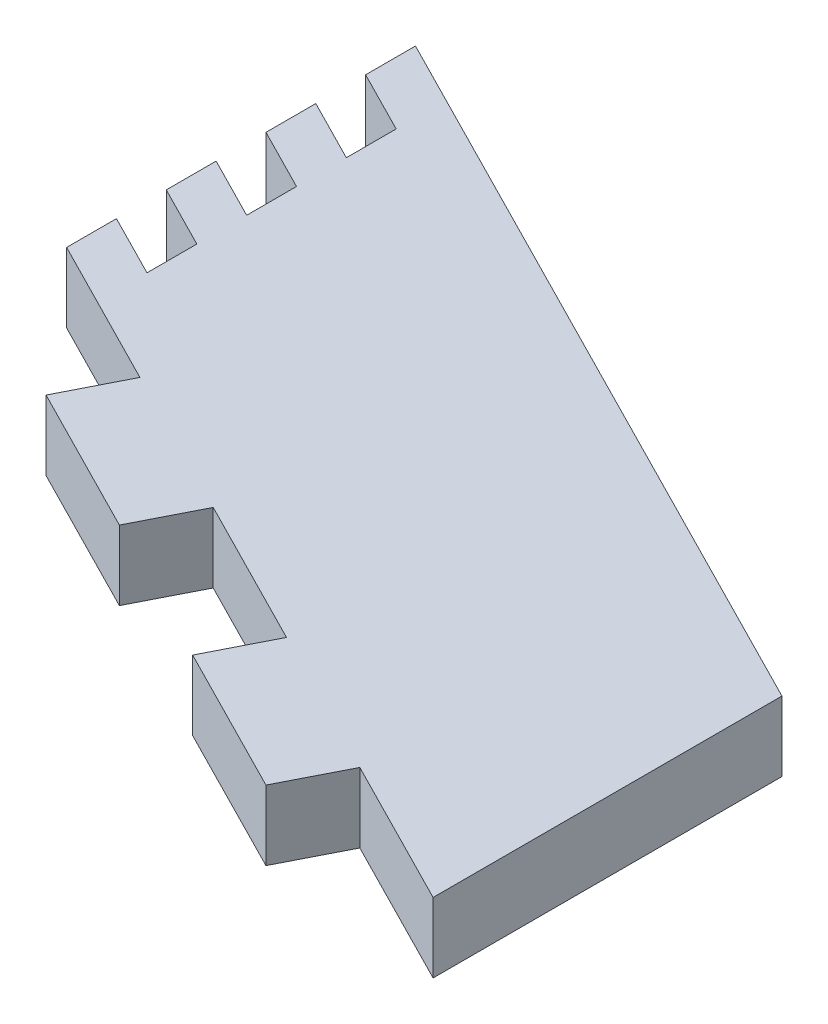
ISO-10303-21;
HEADER;
FILE_DESCRIPTION(('STEP AP214'),'2;1');
FILE_NAME('part.step','',(''),(''),'','','');
FILE_SCHEMA(('AUTOMOTIVE_DESIGN { 1 0 10303 214 1 1 1 1 }'));
ENDSEC;
DATA;
#1=APPLICATION_CONTEXT('core data for automotive mechanical design processes');
#2=APPLICATION_PROTOCOL_DEFINITION('international standard','automotive_design',2000,#1);
#3=PRODUCT_CONTEXT('',#1,'mechanical');
#4=PRODUCT('Part','Part','',(#3));
#5=PRODUCT_RELATED_PRODUCT_CATEGORY('part','',(#4));
#6=PRODUCT_DEFINITION_FORMATION('','',#4);
#7=PRODUCT_DEFINITION_CONTEXT('part definition',#1,'design');
#8=PRODUCT_DEFINITION('design','',#6,#7);
#9=PRODUCT_DEFINITION_SHAPE('','',#8);
#10=(LENGTH_UNIT() NAMED_UNIT(*) SI_UNIT(.MILLI.,.METRE.));
#11=(NAMED_UNIT(*) PLANE_ANGLE_UNIT() SI_UNIT($,.RADIAN.));
#12=(NAMED_UNIT(*) SI_UNIT($,.STERADIAN.) SOLID_ANGLE_UNIT());
#13=UNCERTAINTY_MEASURE_WITH_UNIT(LENGTH_MEASURE(1.E-05),#10,'distance_accuracy_value','');
#14=(GEOMETRIC_REPRESENTATION_CONTEXT(3) GLOBAL_UNCERTAINTY_ASSIGNED_CONTEXT((#13)) GLOBAL_UNIT_ASSIGNED_CONTEXT((#10,
#11,#12)) REPRESENTATION_CONTEXT('',''));
#15=CARTESIAN_POINT('',(0.,0.,0.));
#16=DIRECTION('',(0.,0.,1.));
#17=DIRECTION('',(1.,0.,0.));
#18=AXIS2_PLACEMENT_3D('',#15,#16,#17);
#19=CARTESIAN_POINT('',(0.,3.,0.));
#20=DIRECTION('',(1.,0.,0.));
#21=DIRECTION('',(0.,0.,-1.));
#22=AXIS2_PLACEMENT_3D('',#19,#20,#21);
#23=PLANE('',#22);
#24=DIRECTION('',(0.,0.,1.));
#25=VECTOR('',#24,1.);
#26=CARTESIAN_POINT('',(0.,3.,0.));
#27=LINE('',#26,#25);
#28=CARTESIAN_POINT('',(0.,3.,-2.14285785714291));
#29=VERTEX_POINT('',#28);
#30=CARTESIAN_POINT('',(0.,3.,0.));
#31=VERTEX_POINT('',#30);
#32=EDGE_CURVE('E355',#29,#31,#27,.T.);
#33=ORIENTED_EDGE('',*,*,#32,.F.);
#34=DIRECTION('',(0.,1.,0.));
#35=VECTOR('',#34,1.);
#36=CARTESIAN_POINT('',(0.,0.,-2.14285785714291));
#37=LINE('',#36,#35);
#38=CARTESIAN_POINT('',(0.,0.,-2.14285785714291));
#39=VERTEX_POINT('',#38);
#40=EDGE_CURVE('E236',#39,#29,#37,.T.);
#41=ORIENTED_EDGE('',*,*,#40,.F.);
#42=DIRECTION('',(0.,0.,1.));
#43=VECTOR('',#42,1.);
#44=CARTESIAN_POINT('',(0.,0.,0.));
#45=LINE('',#44,#43);
#46=CARTESIAN_POINT('',(0.,0.,0.));
#47=VERTEX_POINT('',#46);
#48=EDGE_CURVE('E226',#39,#47,#45,.T.);
#49=ORIENTED_EDGE('',*,*,#48,.T.);
#50=DIRECTION('',(0.,-1.,0.));
#51=VECTOR('',#50,1.);
#52=CARTESIAN_POINT('',(0.,3.,0.));
#53=LINE('',#52,#51);
#54=EDGE_CURVE('E359',#31,#47,#53,.T.);
#55=ORIENTED_EDGE('',*,*,#54,.F.);
#56=EDGE_LOOP('',(#33,#41,#49,#55));
#57=FACE_BOUND('',#56,.T.);
#58=ADVANCED_FACE('F44',(#57),#23,.F.);
#59=CARTESIAN_POINT('',(0.,0.,-6.42857185714291));
#60=VERTEX_POINT('',#59);
#61=CARTESIAN_POINT('',(0.,0.,-4.28571485714291));
#62=VERTEX_POINT('',#61);
#63=EDGE_CURVE('E432',#60,#62,#45,.T.);
#64=ORIENTED_EDGE('',*,*,#63,.T.);
#65=DIRECTION('',(0.,1.,0.));
#66=VECTOR('',#65,1.);
#67=CARTESIAN_POINT('',(0.,0.,-4.28571485714291));
#68=LINE('',#67,#66);
#69=CARTESIAN_POINT('',(0.,3.,-4.28571485714291));
#70=VERTEX_POINT('',#69);
#71=EDGE_CURVE('E239',#62,#70,#68,.T.);
#72=ORIENTED_EDGE('',*,*,#71,.T.);
#73=CARTESIAN_POINT('',(0.,3.,-6.42857185714291));
#74=VERTEX_POINT('',#73);
#75=EDGE_CURVE('E431',#74,#70,#27,.T.);
#76=ORIENTED_EDGE('',*,*,#75,.F.);
#77=DIRECTION('',(0.,1.,0.));
#78=VECTOR('',#77,1.);
#79=CARTESIAN_POINT('',(0.,0.,-6.42857185714291));
#80=LINE('',#79,#78);
#81=EDGE_CURVE('E247',#60,#74,#80,.T.);
#82=ORIENTED_EDGE('',*,*,#81,.F.);
#83=EDGE_LOOP('',(#64,#72,#76,#82));
#84=FACE_BOUND('',#83,.T.);
#85=ADVANCED_FACE('F455',(#84),#23,.F.);
#86=CARTESIAN_POINT('',(0.,0.,-10.7142858571429));
#87=VERTEX_POINT('',#86);
#88=CARTESIAN_POINT('',(0.,0.,-8.57142885714291));
#89=VERTEX_POINT('',#88);
#90=EDGE_CURVE('E371',#87,#89,#45,.T.);
#91=ORIENTED_EDGE('',*,*,#90,.T.);
#92=DIRECTION('',(0.,1.,0.));
#93=VECTOR('',#92,1.);
#94=CARTESIAN_POINT('',(0.,0.,-8.57142885714291));
#95=LINE('',#94,#93);
#96=CARTESIAN_POINT('',(0.,3.,-8.57142885714291));
#97=VERTEX_POINT('',#96);
#98=EDGE_CURVE('E67',#89,#97,#95,.T.);
#99=ORIENTED_EDGE('',*,*,#98,.T.);
#100=CARTESIAN_POINT('',(0.,3.,-10.7142858571429));
#101=VERTEX_POINT('',#100);
#102=EDGE_CURVE('E360',#101,#97,#27,.T.);
#103=ORIENTED_EDGE('',*,*,#102,.F.);
#104=DIRECTION('',(0.,1.,0.));
#105=VECTOR('',#104,1.);
#106=CARTESIAN_POINT('',(0.,0.,-10.7142858571429));
#107=LINE('',#106,#105);
#108=EDGE_CURVE('E272',#87,#101,#107,.T.);
#109=ORIENTED_EDGE('',*,*,#108,.F.);
#110=EDGE_LOOP('',(#91,#99,#103,#109));
#111=FACE_BOUND('',#110,.T.);
#112=ADVANCED_FACE('F441',(#111),#23,.F.);
#113=CARTESIAN_POINT('',(32.0847879927621,3.,16.3268606737336));
#114=DIRECTION('',(0.453523907603711,0.,-0.891244110910058));
#115=DIRECTION('',(-0.891244110910059,0.,-0.453523907603711));
#116=AXIS2_PLACEMENT_3D('',#113,#114,#115);
#117=PLANE('',#116);
#118=DIRECTION('',(0.891244110910059,0.,0.453523907603711));
#119=VECTOR('',#118,1.);
#120=CARTESIAN_POINT('',(32.0847879927621,3.,16.3268606737336));
#121=LINE('',#120,#119);
#122=CARTESIAN_POINT('',(12.8339151939046,3.,6.53074426786497));
#123=VERTEX_POINT('',#122);
#124=CARTESIAN_POINT('',(19.2508727924571,3.,9.79611640261169));
#125=VERTEX_POINT('',#124);
#126=EDGE_CURVE('E350',#123,#125,#121,.T.);
#127=ORIENTED_EDGE('',*,*,#126,.F.);
#128=DIRECTION('',(0.,1.,0.));
#129=VECTOR('',#128,1.);
#130=CARTESIAN_POINT('',(12.8339151939046,0.,6.53074426786497));
#131=LINE('',#130,#129);
#132=CARTESIAN_POINT('',(12.8339151939046,0.,6.53074426786497));
#133=VERTEX_POINT('',#132);
#134=EDGE_CURVE('E238',#133,#123,#131,.T.);
#135=ORIENTED_EDGE('',*,*,#134,.F.);
#136=DIRECTION('',(0.891244110910059,0.,0.453523907603711));
#137=VECTOR('',#136,1.);
#138=CARTESIAN_POINT('',(32.0847879927621,0.,16.3268606737336));
#139=LINE('',#138,#137);
#140=CARTESIAN_POINT('',(19.2508727924571,0.,9.79611640261169));
#141=VERTEX_POINT('',#140);
#142=EDGE_CURVE('E364',#133,#141,#139,.T.);
#143=ORIENTED_EDGE('',*,*,#142,.T.);
#144=DIRECTION('',(0.,1.,0.));
#145=VECTOR('',#144,1.);
#146=CARTESIAN_POINT('',(19.2508727924571,0.,9.79611640261169));
#147=LINE('',#146,#145);
#148=EDGE_CURVE('E328',#141,#125,#147,.T.);
#149=ORIENTED_EDGE('',*,*,#148,.T.);
#150=EDGE_LOOP('',(#127,#135,#143,#149));
#151=FACE_BOUND('',#150,.T.);
#152=ADVANCED_FACE('F404',(#151),#117,.F.);
#153=CARTESIAN_POINT('',(25.6678303910095,3.,13.0614885373584));
#154=VERTEX_POINT('',#153);
#155=CARTESIAN_POINT('',(32.0847879927621,3.,16.3268606737336));
#156=VERTEX_POINT('',#155);
#157=EDGE_CURVE('E351',#154,#156,#121,.T.);
#158=ORIENTED_EDGE('',*,*,#157,.F.);
#159=DIRECTION('',(0.,1.,0.));
#160=VECTOR('',#159,1.);
#161=CARTESIAN_POINT('',(25.6678303910095,0.,13.0614885373584));
#162=LINE('',#161,#160);
#163=CARTESIAN_POINT('',(25.6678303910095,0.,13.0614885373584));
#164=VERTEX_POINT('',#163);
#165=EDGE_CURVE('E336',#164,#154,#162,.T.);
#166=ORIENTED_EDGE('',*,*,#165,.F.);
#167=CARTESIAN_POINT('',(32.0847879927621,0.,16.3268606737336));
#168=VERTEX_POINT('',#167);
#169=EDGE_CURVE('E339',#164,#168,#139,.T.);
#170=ORIENTED_EDGE('',*,*,#169,.T.);
#171=DIRECTION('',(0.,-1.,0.));
#172=VECTOR('',#171,1.);
#173=CARTESIAN_POINT('',(32.0847879927621,3.,16.3268606737336));
#174=LINE('',#173,#172);
#175=EDGE_CURVE('E11',#156,#168,#174,.T.);
#176=ORIENTED_EDGE('',*,*,#175,.F.);
#177=EDGE_LOOP('',(#158,#166,#170,#176));
#178=FACE_BOUND('',#177,.T.);
#179=ADVANCED_FACE('F398',(#178),#117,.F.);
#180=CARTESIAN_POINT('',(6.41695759535222,0.,3.26537213311825));
#181=VERTEX_POINT('',#180);
#182=EDGE_CURVE('E361',#47,#181,#139,.T.);
#183=ORIENTED_EDGE('',*,*,#182,.T.);
#184=DIRECTION('',(0.,1.,0.));
#185=VECTOR('',#184,1.);
#186=CARTESIAN_POINT('',(6.41695759535222,0.,3.26537213311825));
#187=LINE('',#186,#185);
#188=CARTESIAN_POINT('',(6.41695759535222,3.,3.26537213311825));
#189=VERTEX_POINT('',#188);
#190=EDGE_CURVE('E291',#181,#189,#187,.T.);
#191=ORIENTED_EDGE('',*,*,#190,.T.);
#192=EDGE_CURVE('E346',#31,#189,#121,.T.);
#193=ORIENTED_EDGE('',*,*,#192,.F.);
#194=ORIENTED_EDGE('',*,*,#54,.T.);
#195=EDGE_LOOP('',(#183,#191,#193,#194));
#196=FACE_BOUND('',#195,.T.);
#197=ADVANCED_FACE('F46',(#196),#117,.F.);
#198=CARTESIAN_POINT('',(32.0847879927621,3.,1.32686067373359));
#199=DIRECTION('',(-1.,0.,0.));
#200=DIRECTION('',(0.,0.,1.));
#201=AXIS2_PLACEMENT_3D('',#198,#199,#200);
#202=PLANE('',#201);
#203=DIRECTION('',(0.,0.,-1.));
#204=VECTOR('',#203,1.);
#205=CARTESIAN_POINT('',(32.0847879927621,0.,1.32686067373359));
#206=LINE('',#205,#204);
#207=CARTESIAN_POINT('',(32.0847879927621,0.,1.32686067373359));
#208=VERTEX_POINT('',#207);
#209=EDGE_CURVE('E363',#168,#208,#206,.T.);
#210=ORIENTED_EDGE('',*,*,#209,.T.);
#211=DIRECTION('',(0.,-1.,0.));
#212=VECTOR('',#211,1.);
#213=CARTESIAN_POINT('',(32.0847879927621,3.,1.32686067373359));
#214=LINE('',#213,#212);
#215=CARTESIAN_POINT('',(32.0847879927621,3.,1.32686067373359));
#216=VERTEX_POINT('',#215);
#217=EDGE_CURVE('E52',#216,#208,#214,.T.);
#218=ORIENTED_EDGE('',*,*,#217,.F.);
#219=DIRECTION('',(0.,0.,-1.));
#220=VECTOR('',#219,1.);
#221=CARTESIAN_POINT('',(32.0847879927621,3.,1.32686067373359));
#222=LINE('',#221,#220);
#223=EDGE_CURVE('E349',#156,#216,#222,.T.);
#224=ORIENTED_EDGE('',*,*,#223,.F.);
#225=ORIENTED_EDGE('',*,*,#175,.T.);
#226=EDGE_LOOP('',(#210,#218,#224,#225));
#227=FACE_BOUND('',#226,.T.);
#228=ADVANCED_FACE('F396',(#227),#202,.F.);
#229=CARTESIAN_POINT('',(0.,3.,-15.));
#230=DIRECTION('',(-0.453523907603711,0.,0.891244110910058));
#231=DIRECTION('',(0.891244110910059,0.,0.453523907603711));
#232=AXIS2_PLACEMENT_3D('',#229,#230,#231);
#233=PLANE('',#232);
#234=DIRECTION('',(-0.891244110910059,0.,-0.453523907603711));
#235=VECTOR('',#234,1.);
#236=CARTESIAN_POINT('',(0.,0.,-15.));
#237=LINE('',#236,#235);
#238=CARTESIAN_POINT('',(0.,0.,-15.));
#239=VERTEX_POINT('',#238);
#240=EDGE_CURVE('E366',#208,#239,#237,.T.);
#241=ORIENTED_EDGE('',*,*,#240,.T.);
#242=DIRECTION('',(0.,-1.,0.));
#243=VECTOR('',#242,1.);
#244=CARTESIAN_POINT('',(0.,3.,-15.));
#245=LINE('',#244,#243);
#246=CARTESIAN_POINT('',(0.,3.,-15.));
#247=VERTEX_POINT('',#246);
#248=EDGE_CURVE('E374',#247,#239,#245,.T.);
#249=ORIENTED_EDGE('',*,*,#248,.F.);
#250=DIRECTION('',(-0.891244110910059,0.,-0.453523907603711));
#251=VECTOR('',#250,1.);
#252=CARTESIAN_POINT('',(0.,3.,-15.));
#253=LINE('',#252,#251);
#254=EDGE_CURVE('E353',#216,#247,#253,.T.);
#255=ORIENTED_EDGE('',*,*,#254,.F.);
#256=ORIENTED_EDGE('',*,*,#217,.T.);
#257=EDGE_LOOP('',(#241,#249,#255,#256));
#258=FACE_BOUND('',#257,.T.);
#259=ADVANCED_FACE('F381',(#258),#233,.F.);
#260=CARTESIAN_POINT('',(0.,0.,-12.8571428571429));
#261=VERTEX_POINT('',#260);
#262=EDGE_CURVE('E368',#239,#261,#45,.T.);
#263=ORIENTED_EDGE('',*,*,#262,.T.);
#264=DIRECTION('',(0.,1.,0.));
#265=VECTOR('',#264,1.);
#266=CARTESIAN_POINT('',(0.,0.,-12.8571428571429));
#267=LINE('',#266,#265);
#268=CARTESIAN_POINT('',(0.,3.,-12.8571428571429));
#269=VERTEX_POINT('',#268);
#270=EDGE_CURVE('E269',#261,#269,#267,.T.);
#271=ORIENTED_EDGE('',*,*,#270,.T.);
#272=EDGE_CURVE('E356',#247,#269,#27,.T.);
#273=ORIENTED_EDGE('',*,*,#272,.F.);
#274=ORIENTED_EDGE('',*,*,#248,.T.);
#275=EDGE_LOOP('',(#263,#271,#273,#274));
#276=FACE_BOUND('',#275,.T.);
#277=ADVANCED_FACE('F389',(#276),#23,.F.);
#278=CARTESIAN_POINT('',(0.,3.,0.));
#279=DIRECTION('',(0.,-1.,0.));
#280=DIRECTION('',(0.,0.,-1.));
#281=AXIS2_PLACEMENT_3D('',#278,#279,#280);
#282=PLANE('',#281);
#283=DIRECTION('',(0.,0.,-1.));
#284=VECTOR('',#283,1.);
#285=CARTESIAN_POINT('',(2.67373233273017,3.,-0.782286134331796));
#286=LINE('',#285,#284);
#287=CARTESIAN_POINT('',(2.67373233273017,3.,-0.782286134331796));
#288=VERTEX_POINT('',#287);
#289=CARTESIAN_POINT('',(2.67373233273017,3.,-2.92514313433179));
#290=VERTEX_POINT('',#289);
#291=EDGE_CURVE('E229',#288,#290,#286,.T.);
#292=ORIENTED_EDGE('',*,*,#291,.F.);
#293=DIRECTION('',(0.89124411091006,0.,0.453523907603708));
#294=VECTOR('',#293,1.);
#295=CARTESIAN_POINT('',(0.,3.,-2.14285785714291));
#296=LINE('',#295,#294);
#297=EDGE_CURVE('E212',#29,#288,#296,.T.);
#298=ORIENTED_EDGE('',*,*,#297,.F.);
#299=ORIENTED_EDGE('',*,*,#32,.T.);
#300=ORIENTED_EDGE('',*,*,#192,.T.);
#301=DIRECTION('',(-0.453552054669089,0.,0.891229787263334));
#302=VECTOR('',#301,1.);
#303=CARTESIAN_POINT('',(6.41695759535222,3.,3.26537213311825));
#304=LINE('',#303,#302);
#305=CARTESIAN_POINT('',(5.05588889847505,3.,5.93987212199747));
#306=VERTEX_POINT('',#305);
#307=EDGE_CURVE('E307',#189,#306,#304,.T.);
#308=ORIENTED_EDGE('',*,*,#307,.T.);
#309=DIRECTION('',(0.891244110910059,0.,0.453523907603711));
#310=VECTOR('',#309,1.);
#311=CARTESIAN_POINT('',(11.4728464970275,3.,9.20524425674419));
#312=LINE('',#311,#310);
#313=CARTESIAN_POINT('',(11.4728464970275,3.,9.20524425674419));
#314=VERTEX_POINT('',#313);
#315=EDGE_CURVE('E303',#306,#314,#312,.T.);
#316=ORIENTED_EDGE('',*,*,#315,.T.);
#317=DIRECTION('',(0.453552054669089,0.,-0.891229787263334));
#318=VECTOR('',#317,1.);
#319=CARTESIAN_POINT('',(12.8339151939046,3.,6.53074426786497));
#320=LINE('',#319,#318);
#321=EDGE_CURVE('E300',#314,#123,#320,.T.);
#322=ORIENTED_EDGE('',*,*,#321,.T.);
#323=ORIENTED_EDGE('',*,*,#126,.T.);
#324=DIRECTION('',(-0.45355205466909,0.,0.891229787263334));
#325=VECTOR('',#324,1.);
#326=CARTESIAN_POINT('',(19.2508727924571,3.,9.79611640261169));
#327=LINE('',#326,#325);
#328=CARTESIAN_POINT('',(17.8898040955799,3.,12.4706163914909));
#329=VERTEX_POINT('',#328);
#330=EDGE_CURVE('E310',#125,#329,#327,.T.);
#331=ORIENTED_EDGE('',*,*,#330,.T.);
#332=DIRECTION('',(0.891244110910059,0.,0.45352390760371));
#333=VECTOR('',#332,1.);
#334=CARTESIAN_POINT('',(24.3067616941323,3.,15.7359885262376));
#335=LINE('',#334,#333);
#336=CARTESIAN_POINT('',(24.3067616941323,3.,15.7359885262376));
#337=VERTEX_POINT('',#336);
#338=EDGE_CURVE('E331',#329,#337,#335,.T.);
#339=ORIENTED_EDGE('',*,*,#338,.T.);
#340=DIRECTION('',(0.453552054669084,0.,-0.891229787263337));
#341=VECTOR('',#340,1.);
#342=CARTESIAN_POINT('',(25.6678303910095,3.,13.0614885373584));
#343=LINE('',#342,#341);
#344=EDGE_CURVE('E322',#337,#154,#343,.T.);
#345=ORIENTED_EDGE('',*,*,#344,.T.);
#346=ORIENTED_EDGE('',*,*,#157,.T.);
#347=ORIENTED_EDGE('',*,*,#223,.T.);
#348=ORIENTED_EDGE('',*,*,#254,.T.);
#349=ORIENTED_EDGE('',*,*,#272,.T.);
#350=DIRECTION('',(-0.89124411091006,0.,-0.453523907603709));
#351=VECTOR('',#350,1.);
#352=CARTESIAN_POINT('',(0.,3.,-12.8571428571429));
#353=LINE('',#352,#351);
#354=CARTESIAN_POINT('',(2.67373233273017,3.,-11.4965711343318));
#355=VERTEX_POINT('',#354);
#356=EDGE_CURVE('E279',#355,#269,#353,.T.);
#357=ORIENTED_EDGE('',*,*,#356,.F.);
#358=DIRECTION('',(0.,0.,-1.));
#359=VECTOR('',#358,1.);
#360=CARTESIAN_POINT('',(2.67373233273017,3.,-11.4965711343318));
#361=LINE('',#360,#359);
#362=CARTESIAN_POINT('',(2.67373233273017,3.,-9.35371413433179));
#363=VERTEX_POINT('',#362);
#364=EDGE_CURVE('E251',#363,#355,#361,.T.);
#365=ORIENTED_EDGE('',*,*,#364,.F.);
#366=DIRECTION('',(0.891244110910059,0.,0.453523907603709));
#367=VECTOR('',#366,1.);
#368=CARTESIAN_POINT('',(2.67373233273017,3.,-9.35371413433179));
#369=LINE('',#368,#367);
#370=EDGE_CURVE('E276',#101,#363,#369,.T.);
#371=ORIENTED_EDGE('',*,*,#370,.F.);
#372=ORIENTED_EDGE('',*,*,#102,.T.);
#373=DIRECTION('',(-0.89124411091006,0.,-0.453523907603708));
#374=VECTOR('',#373,1.);
#375=CARTESIAN_POINT('',(0.,3.,-8.57142885714291));
#376=LINE('',#375,#374);
#377=CARTESIAN_POINT('',(2.67373233273017,3.,-7.21085713433179));
#378=VERTEX_POINT('',#377);
#379=EDGE_CURVE('E255',#378,#97,#376,.T.);
#380=ORIENTED_EDGE('',*,*,#379,.F.);
#381=DIRECTION('',(0.,0.,-1.));
#382=VECTOR('',#381,1.);
#383=CARTESIAN_POINT('',(2.67373233273017,3.,-7.21085713433179));
#384=LINE('',#383,#382);
#385=CARTESIAN_POINT('',(2.67373233273017,3.,-5.06800013433179));
#386=VERTEX_POINT('',#385);
#387=EDGE_CURVE('E234',#386,#378,#384,.T.);
#388=ORIENTED_EDGE('',*,*,#387,.F.);
#389=DIRECTION('',(0.89124411091006,0.,0.453523907603708));
#390=VECTOR('',#389,1.);
#391=CARTESIAN_POINT('',(2.67373233273017,3.,-5.06800013433179));
#392=LINE('',#391,#390);
#393=EDGE_CURVE('E252',#74,#386,#392,.T.);
#394=ORIENTED_EDGE('',*,*,#393,.F.);
#395=ORIENTED_EDGE('',*,*,#75,.T.);
#396=DIRECTION('',(-0.89124411091006,0.,-0.453523907603709));
#397=VECTOR('',#396,1.);
#398=CARTESIAN_POINT('',(2.67373233273017,3.,-2.92514313433179));
#399=LINE('',#398,#397);
#400=EDGE_CURVE('E227',#290,#70,#399,.T.);
#401=ORIENTED_EDGE('',*,*,#400,.F.);
#402=EDGE_LOOP('',(#292,#298,#299,#300,#308,#316,#322,#323,#331,#339,#345,#346,#347,#348,#349,
#357,#365,#371,#372,#380,#388,#394,#395,#401));
#403=FACE_BOUND('',#402,.T.);
#404=ADVANCED_FACE('F393',(#403),#282,.F.);
#405=CARTESIAN_POINT('',(0.,0.,0.));
#406=DIRECTION('',(0.,-1.,0.));
#407=DIRECTION('',(0.,0.,-1.));
#408=AXIS2_PLACEMENT_3D('',#405,#406,#407);
#409=PLANE('',#408);
#410=DIRECTION('',(0.89124411091006,0.,0.453523907603708));
#411=VECTOR('',#410,1.);
#412=CARTESIAN_POINT('',(0.,0.,-2.14285785714291));
#413=LINE('',#412,#411);
#414=CARTESIAN_POINT('',(2.67373233273017,0.,-0.782286134331796));
#415=VERTEX_POINT('',#414);
#416=EDGE_CURVE('E209',#39,#415,#413,.T.);
#417=ORIENTED_EDGE('',*,*,#416,.T.);
#418=DIRECTION('',(0.,0.,-1.));
#419=VECTOR('',#418,1.);
#420=CARTESIAN_POINT('',(2.67373233273017,0.,-0.782286134331796));
#421=LINE('',#420,#419);
#422=CARTESIAN_POINT('',(2.67373233273017,0.,-2.92514313433179));
#423=VERTEX_POINT('',#422);
#424=EDGE_CURVE('E219',#415,#423,#421,.T.);
#425=ORIENTED_EDGE('',*,*,#424,.T.);
#426=DIRECTION('',(-0.89124411091006,0.,-0.453523907603709));
#427=VECTOR('',#426,1.);
#428=CARTESIAN_POINT('',(2.67373233273017,0.,-2.92514313433179));
#429=LINE('',#428,#427);
#430=EDGE_CURVE('E59',#423,#62,#429,.T.);
#431=ORIENTED_EDGE('',*,*,#430,.T.);
#432=ORIENTED_EDGE('',*,*,#63,.F.);
#433=DIRECTION('',(0.89124411091006,0.,0.453523907603708));
#434=VECTOR('',#433,1.);
#435=CARTESIAN_POINT('',(2.67373233273017,0.,-5.06800013433179));
#436=LINE('',#435,#434);
#437=CARTESIAN_POINT('',(2.67373233273017,0.,-5.06800013433179));
#438=VERTEX_POINT('',#437);
#439=EDGE_CURVE('E245',#60,#438,#436,.T.);
#440=ORIENTED_EDGE('',*,*,#439,.T.);
#441=DIRECTION('',(0.,0.,-1.));
#442=VECTOR('',#441,1.);
#443=CARTESIAN_POINT('',(2.67373233273017,0.,-7.21085713433179));
#444=LINE('',#443,#442);
#445=CARTESIAN_POINT('',(2.67373233273017,0.,-7.21085713433179));
#446=VERTEX_POINT('',#445);
#447=EDGE_CURVE('E256',#438,#446,#444,.T.);
#448=ORIENTED_EDGE('',*,*,#447,.T.);
#449=DIRECTION('',(-0.89124411091006,0.,-0.453523907603708));
#450=VECTOR('',#449,1.);
#451=CARTESIAN_POINT('',(0.,0.,-8.57142885714291));
#452=LINE('',#451,#450);
#453=EDGE_CURVE('E262',#446,#89,#452,.T.);
#454=ORIENTED_EDGE('',*,*,#453,.T.);
#455=ORIENTED_EDGE('',*,*,#90,.F.);
#456=DIRECTION('',(0.891244110910059,0.,0.453523907603709));
#457=VECTOR('',#456,1.);
#458=CARTESIAN_POINT('',(2.67373233273017,0.,-9.35371413433179));
#459=LINE('',#458,#457);
#460=CARTESIAN_POINT('',(2.67373233273017,0.,-9.35371413433179));
#461=VERTEX_POINT('',#460);
#462=EDGE_CURVE('E268',#87,#461,#459,.T.);
#463=ORIENTED_EDGE('',*,*,#462,.T.);
#464=DIRECTION('',(0.,0.,-1.));
#465=VECTOR('',#464,1.);
#466=CARTESIAN_POINT('',(2.67373233273017,0.,-11.4965711343318));
#467=LINE('',#466,#465);
#468=CARTESIAN_POINT('',(2.67373233273017,0.,-11.4965711343318));
#469=VERTEX_POINT('',#468);
#470=EDGE_CURVE('E280',#461,#469,#467,.T.);
#471=ORIENTED_EDGE('',*,*,#470,.T.);
#472=DIRECTION('',(-0.89124411091006,0.,-0.453523907603709));
#473=VECTOR('',#472,1.);
#474=CARTESIAN_POINT('',(0.,0.,-12.8571428571429));
#475=LINE('',#474,#473);
#476=EDGE_CURVE('E286',#469,#261,#475,.T.);
#477=ORIENTED_EDGE('',*,*,#476,.T.);
#478=ORIENTED_EDGE('',*,*,#262,.F.);
#479=ORIENTED_EDGE('',*,*,#240,.F.);
#480=ORIENTED_EDGE('',*,*,#209,.F.);
#481=ORIENTED_EDGE('',*,*,#169,.F.);
#482=DIRECTION('',(0.453552054669084,0.,-0.891229787263337));
#483=VECTOR('',#482,1.);
#484=CARTESIAN_POINT('',(25.6678303910095,0.,13.0614885373584));
#485=LINE('',#484,#483);
#486=CARTESIAN_POINT('',(24.3067616941323,0.,15.7359885262376));
#487=VERTEX_POINT('',#486);
#488=EDGE_CURVE('E325',#487,#164,#485,.T.);
#489=ORIENTED_EDGE('',*,*,#488,.F.);
#490=DIRECTION('',(0.891244110910059,0.,0.45352390760371));
#491=VECTOR('',#490,1.);
#492=CARTESIAN_POINT('',(24.3067616941323,0.,15.7359885262376));
#493=LINE('',#492,#491);
#494=CARTESIAN_POINT('',(17.8898040955799,0.,12.4706163914909));
#495=VERTEX_POINT('',#494);
#496=EDGE_CURVE('E321',#495,#487,#493,.T.);
#497=ORIENTED_EDGE('',*,*,#496,.F.);
#498=DIRECTION('',(-0.45355205466909,0.,0.891229787263334));
#499=VECTOR('',#498,1.);
#500=CARTESIAN_POINT('',(19.2508727924571,0.,9.79611640261169));
#501=LINE('',#500,#499);
#502=EDGE_CURVE('E318',#141,#495,#501,.T.);
#503=ORIENTED_EDGE('',*,*,#502,.F.);
#504=ORIENTED_EDGE('',*,*,#142,.F.);
#505=DIRECTION('',(0.453552054669089,0.,-0.891229787263334));
#506=VECTOR('',#505,1.);
#507=CARTESIAN_POINT('',(12.8339151939046,0.,6.53074426786497));
#508=LINE('',#507,#506);
#509=CARTESIAN_POINT('',(11.4728464970275,0.,9.20524425674419));
#510=VERTEX_POINT('',#509);
#511=EDGE_CURVE('E293',#510,#133,#508,.T.);
#512=ORIENTED_EDGE('',*,*,#511,.F.);
#513=DIRECTION('',(0.891244110910059,0.,0.453523907603711));
#514=VECTOR('',#513,1.);
#515=CARTESIAN_POINT('',(11.4728464970275,0.,9.20524425674419));
#516=LINE('',#515,#514);
#517=CARTESIAN_POINT('',(5.05588889847505,0.,5.93987212199747));
#518=VERTEX_POINT('',#517);
#519=EDGE_CURVE('E313',#518,#510,#516,.T.);
#520=ORIENTED_EDGE('',*,*,#519,.F.);
#521=DIRECTION('',(-0.453552054669089,0.,0.891229787263334));
#522=VECTOR('',#521,1.);
#523=CARTESIAN_POINT('',(6.41695759535222,0.,3.26537213311825));
#524=LINE('',#523,#522);
#525=EDGE_CURVE('E304',#181,#518,#524,.T.);
#526=ORIENTED_EDGE('',*,*,#525,.F.);
#527=ORIENTED_EDGE('',*,*,#182,.F.);
#528=ORIENTED_EDGE('',*,*,#48,.F.);
#529=EDGE_LOOP('',(#417,#425,#431,#432,#440,#448,#454,#455,#463,#471,#477,#478,#479,#480,#481,
#489,#497,#503,#504,#512,#520,#526,#527,#528));
#530=FACE_BOUND('',#529,.T.);
#531=ADVANCED_FACE('F224',(#530),#409,.T.);
#532=CARTESIAN_POINT('',(25.6678303910095,0.,13.0614885373584));
#533=DIRECTION('',(0.891229787263337,0.,0.453552054669084));
#534=DIRECTION('',(0.453552054669084,0.,-0.891229787263337));
#535=AXIS2_PLACEMENT_3D('',#532,#533,#534);
#536=PLANE('',#535);
#537=ORIENTED_EDGE('',*,*,#344,.F.);
#538=DIRECTION('',(0.,1.,0.));
#539=VECTOR('',#538,1.);
#540=CARTESIAN_POINT('',(24.3067616941323,0.,15.7359885262376));
#541=LINE('',#540,#539);
#542=EDGE_CURVE('E340',#487,#337,#541,.T.);
#543=ORIENTED_EDGE('',*,*,#542,.F.);
#544=ORIENTED_EDGE('',*,*,#488,.T.);
#545=ORIENTED_EDGE('',*,*,#165,.T.);
#546=EDGE_LOOP('',(#537,#543,#544,#545));
#547=FACE_BOUND('',#546,.T.);
#548=ADVANCED_FACE('F523',(#547),#536,.T.);
#549=CARTESIAN_POINT('',(24.3067616941323,0.,15.7359885262376));
#550=DIRECTION('',(-0.45352390760371,0.,0.891244110910059));
#551=DIRECTION('',(0.891244110910059,0.,0.45352390760371));
#552=AXIS2_PLACEMENT_3D('',#549,#550,#551);
#553=PLANE('',#552);
#554=ORIENTED_EDGE('',*,*,#338,.F.);
#555=DIRECTION('',(0.,1.,0.));
#556=VECTOR('',#555,1.);
#557=CARTESIAN_POINT('',(17.8898040955799,0.,12.4706163914909));
#558=LINE('',#557,#556);
#559=EDGE_CURVE('E342',#495,#329,#558,.T.);
#560=ORIENTED_EDGE('',*,*,#559,.F.);
#561=ORIENTED_EDGE('',*,*,#496,.T.);
#562=ORIENTED_EDGE('',*,*,#542,.T.);
#563=EDGE_LOOP('',(#554,#560,#561,#562));
#564=FACE_BOUND('',#563,.T.);
#565=ADVANCED_FACE('F413',(#564),#553,.T.);
#566=CARTESIAN_POINT('',(19.2508727924571,0.,9.79611640261169));
#567=DIRECTION('',(-0.891229787263334,0.,-0.453552054669089));
#568=DIRECTION('',(-0.45355205466909,0.,0.891229787263334));
#569=AXIS2_PLACEMENT_3D('',#566,#567,#568);
#570=PLANE('',#569);
#571=ORIENTED_EDGE('',*,*,#330,.F.);
#572=ORIENTED_EDGE('',*,*,#148,.F.);
#573=ORIENTED_EDGE('',*,*,#502,.T.);
#574=ORIENTED_EDGE('',*,*,#559,.T.);
#575=EDGE_LOOP('',(#571,#572,#573,#574));
#576=FACE_BOUND('',#575,.T.);
#577=ADVANCED_FACE('F409',(#576),#570,.T.);
#578=CARTESIAN_POINT('',(12.8339151939046,0.,6.53074426786497));
#579=DIRECTION('',(0.891229787263334,0.,0.453552054669089));
#580=DIRECTION('',(0.453552054669089,0.,-0.891229787263334));
#581=AXIS2_PLACEMENT_3D('',#578,#579,#580);
#582=PLANE('',#581);
#583=ORIENTED_EDGE('',*,*,#321,.F.);
#584=DIRECTION('',(0.,1.,0.));
#585=VECTOR('',#584,1.);
#586=CARTESIAN_POINT('',(11.4728464970275,0.,9.20524425674419));
#587=LINE('',#586,#585);
#588=EDGE_CURVE('E296',#510,#314,#587,.T.);
#589=ORIENTED_EDGE('',*,*,#588,.F.);
#590=ORIENTED_EDGE('',*,*,#511,.T.);
#591=ORIENTED_EDGE('',*,*,#134,.T.);
#592=EDGE_LOOP('',(#583,#589,#590,#591));
#593=FACE_BOUND('',#592,.T.);
#594=ADVANCED_FACE('F417',(#593),#582,.T.);
#595=CARTESIAN_POINT('',(11.4728464970275,0.,9.20524425674419));
#596=DIRECTION('',(-0.453523907603711,0.,0.891244110910059));
#597=DIRECTION('',(0.891244110910059,0.,0.453523907603711));
#598=AXIS2_PLACEMENT_3D('',#595,#596,#597);
#599=PLANE('',#598);
#600=ORIENTED_EDGE('',*,*,#315,.F.);
#601=DIRECTION('',(0.,1.,0.));
#602=VECTOR('',#601,1.);
#603=CARTESIAN_POINT('',(5.05588889847505,0.,5.93987212199747));
#604=LINE('',#603,#602);
#605=EDGE_CURVE('E294',#518,#306,#604,.T.);
#606=ORIENTED_EDGE('',*,*,#605,.F.);
#607=ORIENTED_EDGE('',*,*,#519,.T.);
#608=ORIENTED_EDGE('',*,*,#588,.T.);
#609=EDGE_LOOP('',(#600,#606,#607,#608));
#610=FACE_BOUND('',#609,.T.);
#611=ADVANCED_FACE('F557',(#610),#599,.T.);
#612=CARTESIAN_POINT('',(6.41695759535222,0.,3.26537213311825));
#613=DIRECTION('',(-0.891229787263334,0.,-0.453552054669089));
#614=DIRECTION('',(-0.453552054669089,0.,0.891229787263334));
#615=AXIS2_PLACEMENT_3D('',#612,#613,#614);
#616=PLANE('',#615);
#617=ORIENTED_EDGE('',*,*,#307,.F.);
#618=ORIENTED_EDGE('',*,*,#190,.F.);
#619=ORIENTED_EDGE('',*,*,#525,.T.);
#620=ORIENTED_EDGE('',*,*,#605,.T.);
#621=EDGE_LOOP('',(#617,#618,#619,#620));
#622=FACE_BOUND('',#621,.T.);
#623=ADVANCED_FACE('F424',(#622),#616,.T.);
#624=CARTESIAN_POINT('',(2.67373233273017,0.,-11.4965711343318));
#625=DIRECTION('',(1.,0.,0.));
#626=DIRECTION('',(0.,0.,-1.));
#627=AXIS2_PLACEMENT_3D('',#624,#625,#626);
#628=PLANE('',#627);
#629=ORIENTED_EDGE('',*,*,#364,.T.);
#630=DIRECTION('',(0.,1.,0.));
#631=VECTOR('',#630,1.);
#632=CARTESIAN_POINT('',(2.67373233273017,0.,-11.4965711343318));
#633=LINE('',#632,#631);
#634=EDGE_CURVE('E266',#469,#355,#633,.T.);
#635=ORIENTED_EDGE('',*,*,#634,.F.);
#636=ORIENTED_EDGE('',*,*,#470,.F.);
#637=DIRECTION('',(0.,1.,0.));
#638=VECTOR('',#637,1.);
#639=CARTESIAN_POINT('',(2.67373233273017,0.,-9.35371413433179));
#640=LINE('',#639,#638);
#641=EDGE_CURVE('E274',#461,#363,#640,.T.);
#642=ORIENTED_EDGE('',*,*,#641,.T.);
#643=EDGE_LOOP('',(#629,#635,#636,#642));
#644=FACE_BOUND('',#643,.T.);
#645=ADVANCED_FACE('F576',(#644),#628,.F.);
#646=CARTESIAN_POINT('',(2.67373233273017,0.,-9.35371413433179));
#647=DIRECTION('',(-0.453523907603709,0.,0.891244110910059));
#648=DIRECTION('',(0.89124411091006,0.,0.453523907603709));
#649=AXIS2_PLACEMENT_3D('',#646,#647,#648);
#650=PLANE('',#649);
#651=ORIENTED_EDGE('',*,*,#370,.T.);
#652=ORIENTED_EDGE('',*,*,#641,.F.);
#653=ORIENTED_EDGE('',*,*,#462,.F.);
#654=ORIENTED_EDGE('',*,*,#108,.T.);
#655=EDGE_LOOP('',(#651,#652,#653,#654));
#656=FACE_BOUND('',#655,.T.);
#657=ADVANCED_FACE('F624',(#656),#650,.F.);
#658=CARTESIAN_POINT('',(0.,0.,-12.8571428571429));
#659=DIRECTION('',(0.453523907603709,0.,-0.891244110910059));
#660=DIRECTION('',(-0.89124411091006,0.,-0.453523907603709));
#661=AXIS2_PLACEMENT_3D('',#658,#659,#660);
#662=PLANE('',#661);
#663=ORIENTED_EDGE('',*,*,#356,.T.);
#664=ORIENTED_EDGE('',*,*,#270,.F.);
#665=ORIENTED_EDGE('',*,*,#476,.F.);
#666=ORIENTED_EDGE('',*,*,#634,.T.);
#667=EDGE_LOOP('',(#663,#664,#665,#666));
#668=FACE_BOUND('',#667,.T.);
#669=ADVANCED_FACE('F466',(#668),#662,.F.);
#670=CARTESIAN_POINT('',(2.67373233273017,0.,-7.21085713433179));
#671=DIRECTION('',(1.,0.,0.));
#672=DIRECTION('',(0.,0.,-1.));
#673=AXIS2_PLACEMENT_3D('',#670,#671,#672);
#674=PLANE('',#673);
#675=ORIENTED_EDGE('',*,*,#387,.T.);
#676=DIRECTION('',(0.,1.,0.));
#677=VECTOR('',#676,1.);
#678=CARTESIAN_POINT('',(2.67373233273017,0.,-7.21085713433179));
#679=LINE('',#678,#677);
#680=EDGE_CURVE('E243',#446,#378,#679,.T.);
#681=ORIENTED_EDGE('',*,*,#680,.F.);
#682=ORIENTED_EDGE('',*,*,#447,.F.);
#683=DIRECTION('',(0.,1.,0.));
#684=VECTOR('',#683,1.);
#685=CARTESIAN_POINT('',(2.67373233273017,0.,-5.06800013433179));
#686=LINE('',#685,#684);
#687=EDGE_CURVE('E249',#438,#386,#686,.T.);
#688=ORIENTED_EDGE('',*,*,#687,.T.);
#689=EDGE_LOOP('',(#675,#681,#682,#688));
#690=FACE_BOUND('',#689,.T.);
#691=ADVANCED_FACE('F449',(#690),#674,.F.);
#692=CARTESIAN_POINT('',(2.67373233273017,0.,-5.06800013433179));
#693=DIRECTION('',(-0.453523907603708,0.,0.89124411091006));
#694=DIRECTION('',(0.89124411091006,0.,0.453523907603708));
#695=AXIS2_PLACEMENT_3D('',#692,#693,#694);
#696=PLANE('',#695);
#697=ORIENTED_EDGE('',*,*,#393,.T.);
#698=ORIENTED_EDGE('',*,*,#687,.F.);
#699=ORIENTED_EDGE('',*,*,#439,.F.);
#700=ORIENTED_EDGE('',*,*,#81,.T.);
#701=EDGE_LOOP('',(#697,#698,#699,#700));
#702=FACE_BOUND('',#701,.T.);
#703=ADVANCED_FACE('F458',(#702),#696,.F.);
#704=CARTESIAN_POINT('',(0.,0.,-8.57142885714291));
#705=DIRECTION('',(0.453523907603708,0.,-0.89124411091006));
#706=DIRECTION('',(-0.89124411091006,0.,-0.453523907603708));
#707=AXIS2_PLACEMENT_3D('',#704,#705,#706);
#708=PLANE('',#707);
#709=ORIENTED_EDGE('',*,*,#379,.T.);
#710=ORIENTED_EDGE('',*,*,#98,.F.);
#711=ORIENTED_EDGE('',*,*,#453,.F.);
#712=ORIENTED_EDGE('',*,*,#680,.T.);
#713=EDGE_LOOP('',(#709,#710,#711,#712));
#714=FACE_BOUND('',#713,.T.);
#715=ADVANCED_FACE('F445',(#714),#708,.F.);
#716=CARTESIAN_POINT('',(0.,0.,-2.14285785714291));
#717=DIRECTION('',(-0.453523907603708,0.,0.89124411091006));
#718=DIRECTION('',(0.89124411091006,0.,0.453523907603708));
#719=AXIS2_PLACEMENT_3D('',#716,#717,#718);
#720=PLANE('',#719);
#721=ORIENTED_EDGE('',*,*,#297,.T.);
#722=DIRECTION('',(0.,1.,0.));
#723=VECTOR('',#722,1.);
#724=CARTESIAN_POINT('',(2.67373233273017,0.,-0.782286134331796));
#725=LINE('',#724,#723);
#726=EDGE_CURVE('E205',#415,#288,#725,.T.);
#727=ORIENTED_EDGE('',*,*,#726,.F.);
#728=ORIENTED_EDGE('',*,*,#416,.F.);
#729=ORIENTED_EDGE('',*,*,#40,.T.);
#730=EDGE_LOOP('',(#721,#727,#728,#729));
#731=FACE_BOUND('',#730,.T.);
#732=ADVANCED_FACE('F207',(#731),#720,.F.);
#733=CARTESIAN_POINT('',(2.67373233273017,0.,-2.92514313433179));
#734=DIRECTION('',(0.453523907603709,0.,-0.89124411091006));
#735=DIRECTION('',(-0.89124411091006,0.,-0.453523907603709));
#736=AXIS2_PLACEMENT_3D('',#733,#734,#735);
#737=PLANE('',#736);
#738=ORIENTED_EDGE('',*,*,#400,.T.);
#739=ORIENTED_EDGE('',*,*,#71,.F.);
#740=ORIENTED_EDGE('',*,*,#430,.F.);
#741=DIRECTION('',(0.,1.,0.));
#742=VECTOR('',#741,1.);
#743=CARTESIAN_POINT('',(2.67373233273017,0.,-2.92514313433179));
#744=LINE('',#743,#742);
#745=EDGE_CURVE('E216',#423,#290,#744,.T.);
#746=ORIENTED_EDGE('',*,*,#745,.T.);
#747=EDGE_LOOP('',(#738,#739,#740,#746));
#748=FACE_BOUND('',#747,.T.);
#749=ADVANCED_FACE('F456',(#748),#737,.F.);
#750=CARTESIAN_POINT('',(2.67373233273017,0.,-0.782286134331796));
#751=DIRECTION('',(1.,0.,0.));
#752=DIRECTION('',(0.,0.,-1.));
#753=AXIS2_PLACEMENT_3D('',#750,#751,#752);
#754=PLANE('',#753);
#755=ORIENTED_EDGE('',*,*,#291,.T.);
#756=ORIENTED_EDGE('',*,*,#745,.F.);
#757=ORIENTED_EDGE('',*,*,#424,.F.);
#758=ORIENTED_EDGE('',*,*,#726,.T.);
#759=EDGE_LOOP('',(#755,#756,#757,#758));
#760=FACE_BOUND('',#759,.T.);
#761=ADVANCED_FACE('F220',(#760),#754,.F.);
#762=CLOSED_SHELL('',(#58,#85,#112,#152,#179,#197,#228,#259,#277,#404,#531,#548,#565,#577,#594,
#611,#623,#645,#657,#669,#691,#703,#715,#732,#749,#761));
#763=MANIFOLD_SOLID_BREP('B2',#762);
#764=ADVANCED_BREP_SHAPE_REPRESENTATION('',(#18,#763),#14);
#765=SHAPE_DEFINITION_REPRESENTATION(#9,#764);
ENDSEC;
END-ISO-10303-21;
